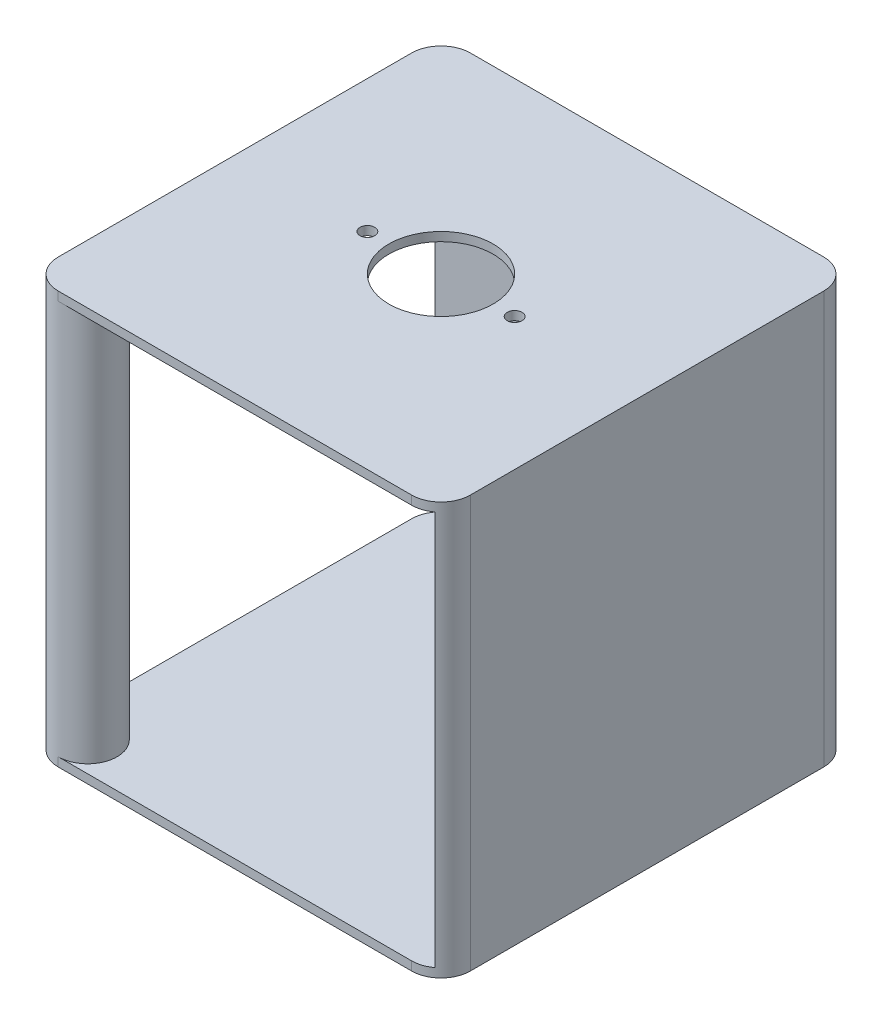
ISO-10303-21;
HEADER;
FILE_DESCRIPTION(('STEP AP214'),'2;1');
FILE_NAME('part.step','',(''),(''),'','','');
FILE_SCHEMA(('AUTOMOTIVE_DESIGN { 1 0 10303 214 1 1 1 1 }'));
ENDSEC;
DATA;
#1=APPLICATION_CONTEXT('core data for automotive mechanical design processes');
#2=APPLICATION_PROTOCOL_DEFINITION('international standard','automotive_design',2000,#1);
#3=PRODUCT_CONTEXT('',#1,'mechanical');
#4=PRODUCT('Part','Part','',(#3));
#5=PRODUCT_RELATED_PRODUCT_CATEGORY('part','',(#4));
#6=PRODUCT_DEFINITION_FORMATION('','',#4);
#7=PRODUCT_DEFINITION_CONTEXT('part definition',#1,'design');
#8=PRODUCT_DEFINITION('design','',#6,#7);
#9=PRODUCT_DEFINITION_SHAPE('','',#8);
#10=(LENGTH_UNIT() NAMED_UNIT(*) SI_UNIT(.MILLI.,.METRE.));
#11=(NAMED_UNIT(*) PLANE_ANGLE_UNIT() SI_UNIT($,.RADIAN.));
#12=(NAMED_UNIT(*) SI_UNIT($,.STERADIAN.) SOLID_ANGLE_UNIT());
#13=UNCERTAINTY_MEASURE_WITH_UNIT(LENGTH_MEASURE(1.E-05),#10,'distance_accuracy_value','');
#14=(GEOMETRIC_REPRESENTATION_CONTEXT(3) GLOBAL_UNCERTAINTY_ASSIGNED_CONTEXT((#13)) GLOBAL_UNIT_ASSIGNED_CONTEXT((#10,
#11,#12)) REPRESENTATION_CONTEXT('',''));
#15=CARTESIAN_POINT('',(0.,0.,0.));
#16=DIRECTION('',(0.,0.,1.));
#17=DIRECTION('',(1.,0.,0.));
#18=AXIS2_PLACEMENT_3D('',#15,#16,#17);
#19=CARTESIAN_POINT('',(38.1,1.905,38.1));
#20=DIRECTION('',(0.,-1.,0.));
#21=DIRECTION('',(0.,0.,-1.));
#22=AXIS2_PLACEMENT_3D('',#19,#20,#21);
#23=CYLINDRICAL_SURFACE('',#22,6.34999999999998);
#24=CARTESIAN_POINT('',(38.1,0.,38.1));
#25=DIRECTION('',(0.,-1.,0.));
#26=DIRECTION('',(0.,0.,-1.));
#27=AXIS2_PLACEMENT_3D('',#24,#25,#26);
#28=CIRCLE('',#27,6.34999999999998);
#29=CARTESIAN_POINT('',(41.91,0.,43.18));
#30=VERTEX_POINT('',#29);
#31=CARTESIAN_POINT('',(38.1,0.,44.45));
#32=VERTEX_POINT('',#31);
#33=EDGE_CURVE('E315',#30,#32,#28,.T.);
#34=ORIENTED_EDGE('',*,*,#33,.F.);
#35=DIRECTION('',(0.,-1.,0.));
#36=VECTOR('',#35,1.);
#37=CARTESIAN_POINT('',(41.91,1.905,43.18));
#38=LINE('',#37,#36);
#39=CARTESIAN_POINT('',(41.91,-85.0899999999999,43.18));
#40=VERTEX_POINT('',#39);
#41=EDGE_CURVE('E176',#40,#30,#38,.F.);
#42=ORIENTED_EDGE('',*,*,#41,.F.);
#43=CARTESIAN_POINT('',(38.1,-85.0899999999999,38.1));
#44=DIRECTION('',(0.,1.,0.));
#45=DIRECTION('',(0.,0.,1.));
#46=AXIS2_PLACEMENT_3D('',#43,#44,#45);
#47=CIRCLE('',#46,6.34999999999998);
#48=CARTESIAN_POINT('',(38.1,-85.0899999999999,44.45));
#49=VERTEX_POINT('',#48);
#50=EDGE_CURVE('E299',#49,#40,#47,.T.);
#51=ORIENTED_EDGE('',*,*,#50,.F.);
#52=DIRECTION('',(0.,-1.,0.));
#53=VECTOR('',#52,1.);
#54=CARTESIAN_POINT('',(38.1,1.905,44.45));
#55=LINE('',#54,#53);
#56=CARTESIAN_POINT('',(38.1,-86.995,44.45));
#57=VERTEX_POINT('',#56);
#58=EDGE_CURVE('E284',#49,#57,#55,.T.);
#59=ORIENTED_EDGE('',*,*,#58,.T.);
#60=CARTESIAN_POINT('',(38.1,-86.995,38.1));
#61=DIRECTION('',(0.,1.,0.));
#62=DIRECTION('',(0.,0.,1.));
#63=AXIS2_PLACEMENT_3D('',#60,#61,#62);
#64=CIRCLE('',#63,6.34999999999998);
#65=CARTESIAN_POINT('',(44.45,-86.995,38.1));
#66=VERTEX_POINT('',#65);
#67=EDGE_CURVE('E237',#57,#66,#64,.T.);
#68=ORIENTED_EDGE('',*,*,#67,.T.);
#69=DIRECTION('',(0.,-1.,0.));
#70=VECTOR('',#69,1.);
#71=CARTESIAN_POINT('',(44.45,1.905,38.1));
#72=LINE('',#71,#70);
#73=CARTESIAN_POINT('',(44.45,1.905,38.1));
#74=VERTEX_POINT('',#73);
#75=EDGE_CURVE('E282',#74,#66,#72,.T.);
#76=ORIENTED_EDGE('',*,*,#75,.F.);
#77=CARTESIAN_POINT('',(38.1,1.905,38.1));
#78=DIRECTION('',(0.,1.,0.));
#79=DIRECTION('',(0.,0.,1.));
#80=AXIS2_PLACEMENT_3D('',#77,#78,#79);
#81=CIRCLE('',#80,6.34999999999998);
#82=CARTESIAN_POINT('',(38.1,1.905,44.45));
#83=VERTEX_POINT('',#82);
#84=EDGE_CURVE('E264',#83,#74,#81,.T.);
#85=ORIENTED_EDGE('',*,*,#84,.F.);
#86=EDGE_CURVE('E285',#83,#32,#55,.T.);
#87=ORIENTED_EDGE('',*,*,#86,.T.);
#88=EDGE_LOOP('',(#34,#42,#51,#59,#68,#76,#85,#87));
#89=FACE_BOUND('',#88,.T.);
#90=ADVANCED_FACE('F45',(#89),#23,.T.);
#91=CARTESIAN_POINT('',(-44.45,1.905,38.1));
#92=DIRECTION('',(1.,0.,0.));
#93=DIRECTION('',(0.,0.,-1.));
#94=AXIS2_PLACEMENT_3D('',#91,#92,#93);
#95=PLANE('',#94);
#96=DIRECTION('',(0.,-1.,0.));
#97=VECTOR('',#96,1.);
#98=CARTESIAN_POINT('',(-44.45,1.905,38.1));
#99=LINE('',#98,#97);
#100=CARTESIAN_POINT('',(-44.45,-85.09,38.1));
#101=VERTEX_POINT('',#100);
#102=CARTESIAN_POINT('',(-44.45,-86.995,38.1));
#103=VERTEX_POINT('',#102);
#104=EDGE_CURVE('E169',#101,#103,#99,.T.);
#105=ORIENTED_EDGE('',*,*,#104,.F.);
#106=DIRECTION('',(0.,0.,1.));
#107=VECTOR('',#106,1.);
#108=CARTESIAN_POINT('',(-44.45,-85.09,-41.91));
#109=LINE('',#108,#107);
#110=CARTESIAN_POINT('',(-44.45,-85.09,-38.1));
#111=VERTEX_POINT('',#110);
#112=EDGE_CURVE('E180',#111,#101,#109,.T.);
#113=ORIENTED_EDGE('',*,*,#112,.F.);
#114=DIRECTION('',(0.,-1.,0.));
#115=VECTOR('',#114,1.);
#116=CARTESIAN_POINT('',(-44.45,1.905,-38.1));
#117=LINE('',#116,#115);
#118=CARTESIAN_POINT('',(-44.45,-86.995,-38.1));
#119=VERTEX_POINT('',#118);
#120=EDGE_CURVE('E200',#111,#119,#117,.T.);
#121=ORIENTED_EDGE('',*,*,#120,.T.);
#122=DIRECTION('',(0.,0.,1.));
#123=VECTOR('',#122,1.);
#124=CARTESIAN_POINT('',(-44.45,-86.995,38.1));
#125=LINE('',#124,#123);
#126=EDGE_CURVE('E193',#119,#103,#125,.T.);
#127=ORIENTED_EDGE('',*,*,#126,.T.);
#128=EDGE_LOOP('',(#105,#113,#121,#127));
#129=FACE_BOUND('',#128,.T.);
#130=ADVANCED_FACE('F191',(#129),#95,.F.);
#131=CARTESIAN_POINT('',(-38.1,1.905,44.45));
#132=DIRECTION('',(0.,0.,-1.));
#133=DIRECTION('',(-1.,0.,0.));
#134=AXIS2_PLACEMENT_3D('',#131,#132,#133);
#135=PLANE('',#134);
#136=ORIENTED_EDGE('',*,*,#58,.F.);
#137=DIRECTION('',(1.,0.,0.));
#138=VECTOR('',#137,1.);
#139=CARTESIAN_POINT('',(38.1,-85.09,44.45));
#140=LINE('',#139,#138);
#141=CARTESIAN_POINT('',(-38.1,-85.09,44.45));
#142=VERTEX_POINT('',#141);
#143=EDGE_CURVE('E304',#142,#49,#140,.T.);
#144=ORIENTED_EDGE('',*,*,#143,.F.);
#145=DIRECTION('',(0.,-1.,0.));
#146=VECTOR('',#145,1.);
#147=CARTESIAN_POINT('',(-38.1,1.905,44.45));
#148=LINE('',#147,#146);
#149=CARTESIAN_POINT('',(-38.1,-86.995,44.45));
#150=VERTEX_POINT('',#149);
#151=EDGE_CURVE('E171',#142,#150,#148,.T.);
#152=ORIENTED_EDGE('',*,*,#151,.T.);
#153=DIRECTION('',(1.,0.,0.));
#154=VECTOR('',#153,1.);
#155=CARTESIAN_POINT('',(-38.1,-86.995,44.45));
#156=LINE('',#155,#154);
#157=EDGE_CURVE('E233',#150,#57,#156,.T.);
#158=ORIENTED_EDGE('',*,*,#157,.T.);
#159=EDGE_LOOP('',(#136,#144,#152,#158));
#160=FACE_BOUND('',#159,.T.);
#161=ADVANCED_FACE('F303',(#160),#135,.F.);
#162=CARTESIAN_POINT('',(-38.1,1.905,-38.1));
#163=DIRECTION('',(0.,-1.,0.));
#164=DIRECTION('',(0.,0.,-1.));
#165=AXIS2_PLACEMENT_3D('',#162,#163,#164);
#166=CYLINDRICAL_SURFACE('',#165,6.34999999999999);
#167=ORIENTED_EDGE('',*,*,#120,.F.);
#168=CARTESIAN_POINT('',(-38.1,-85.09,-38.1));
#169=DIRECTION('',(0.,-1.,0.));
#170=DIRECTION('',(1.,0.,0.));
#171=AXIS2_PLACEMENT_3D('',#168,#169,#170);
#172=CIRCLE('',#171,6.34999999999999);
#173=CARTESIAN_POINT('',(-43.18,-85.09,-41.91));
#174=VERTEX_POINT('',#173);
#175=EDGE_CURVE('E183',#111,#174,#172,.T.);
#176=ORIENTED_EDGE('',*,*,#175,.T.);
#177=DIRECTION('',(0.,-1.,0.));
#178=VECTOR('',#177,1.);
#179=CARTESIAN_POINT('',(-43.18,1.905,-41.91));
#180=LINE('',#179,#178);
#181=CARTESIAN_POINT('',(-43.18,0.,-41.91));
#182=VERTEX_POINT('',#181);
#183=EDGE_CURVE('E319',#174,#182,#180,.F.);
#184=ORIENTED_EDGE('',*,*,#183,.T.);
#185=CARTESIAN_POINT('',(-38.1,0.,-38.1));
#186=DIRECTION('',(0.,1.,0.));
#187=DIRECTION('',(0.,0.,1.));
#188=AXIS2_PLACEMENT_3D('',#185,#186,#187);
#189=CIRCLE('',#188,6.34999999999999);
#190=CARTESIAN_POINT('',(-44.45,0.,-38.1));
#191=VERTEX_POINT('',#190);
#192=EDGE_CURVE('E333',#182,#191,#189,.T.);
#193=ORIENTED_EDGE('',*,*,#192,.T.);
#194=CARTESIAN_POINT('',(-44.45,1.905,-38.1));
#195=VERTEX_POINT('',#194);
#196=EDGE_CURVE('E54',#195,#191,#117,.T.);
#197=ORIENTED_EDGE('',*,*,#196,.F.);
#198=CARTESIAN_POINT('',(-38.1,1.905,-38.1));
#199=DIRECTION('',(0.,1.,0.));
#200=DIRECTION('',(0.,0.,1.));
#201=AXIS2_PLACEMENT_3D('',#198,#199,#200);
#202=CIRCLE('',#201,6.34999999999999);
#203=CARTESIAN_POINT('',(-38.1,1.905,-44.45));
#204=VERTEX_POINT('',#203);
#205=EDGE_CURVE('E252',#204,#195,#202,.T.);
#206=ORIENTED_EDGE('',*,*,#205,.F.);
#207=DIRECTION('',(0.,-1.,0.));
#208=VECTOR('',#207,1.);
#209=CARTESIAN_POINT('',(-38.1,1.905,-44.45));
#210=LINE('',#209,#208);
#211=CARTESIAN_POINT('',(-38.1,-86.995,-44.45));
#212=VERTEX_POINT('',#211);
#213=EDGE_CURVE('E222',#204,#212,#210,.T.);
#214=ORIENTED_EDGE('',*,*,#213,.T.);
#215=CARTESIAN_POINT('',(-38.1,-86.995,-38.1));
#216=DIRECTION('',(0.,1.,0.));
#217=DIRECTION('',(0.,0.,1.));
#218=AXIS2_PLACEMENT_3D('',#215,#216,#217);
#219=CIRCLE('',#218,6.34999999999999);
#220=EDGE_CURVE('E215',#212,#119,#219,.T.);
#221=ORIENTED_EDGE('',*,*,#220,.T.);
#222=EDGE_LOOP('',(#167,#176,#184,#193,#197,#206,#214,#221));
#223=FACE_BOUND('',#222,.T.);
#224=ADVANCED_FACE('F47',(#223),#166,.T.);
#225=ORIENTED_EDGE('',*,*,#196,.T.);
#226=DIRECTION('',(0.,0.,1.));
#227=VECTOR('',#226,1.);
#228=CARTESIAN_POINT('',(-44.45,0.,-41.91));
#229=LINE('',#228,#227);
#230=CARTESIAN_POINT('',(-44.45,0.,38.1));
#231=VERTEX_POINT('',#230);
#232=EDGE_CURVE('E188',#191,#231,#229,.T.);
#233=ORIENTED_EDGE('',*,*,#232,.T.);
#234=CARTESIAN_POINT('',(-44.45,1.905,38.1));
#235=VERTEX_POINT('',#234);
#236=EDGE_CURVE('E195',#235,#231,#99,.T.);
#237=ORIENTED_EDGE('',*,*,#236,.F.);
#238=DIRECTION('',(0.,0.,1.));
#239=VECTOR('',#238,1.);
#240=CARTESIAN_POINT('',(-44.45,1.905,38.1));
#241=LINE('',#240,#239);
#242=EDGE_CURVE('E255',#195,#235,#241,.T.);
#243=ORIENTED_EDGE('',*,*,#242,.F.);
#244=EDGE_LOOP('',(#225,#233,#237,#243));
#245=FACE_BOUND('',#244,.T.);
#246=ADVANCED_FACE('F371',(#245),#95,.F.);
#247=CARTESIAN_POINT('',(-38.1,1.905,38.1));
#248=DIRECTION('',(0.,-1.,0.));
#249=DIRECTION('',(0.,0.,-1.));
#250=AXIS2_PLACEMENT_3D('',#247,#248,#249);
#251=CYLINDRICAL_SURFACE('',#250,6.35);
#252=ORIENTED_EDGE('',*,*,#236,.T.);
#253=CARTESIAN_POINT('',(-38.1,0.,38.1));
#254=DIRECTION('',(0.,1.,0.));
#255=DIRECTION('',(0.,0.,1.));
#256=AXIS2_PLACEMENT_3D('',#253,#254,#255);
#257=CIRCLE('',#256,6.35);
#258=CARTESIAN_POINT('',(-38.1,0.,44.45));
#259=VERTEX_POINT('',#258);
#260=EDGE_CURVE('E11',#231,#259,#257,.F.);
#261=ORIENTED_EDGE('',*,*,#260,.T.);
#262=CARTESIAN_POINT('',(-38.1,1.905,44.45));
#263=VERTEX_POINT('',#262);
#264=EDGE_CURVE('E196',#263,#259,#148,.T.);
#265=ORIENTED_EDGE('',*,*,#264,.F.);
#266=CARTESIAN_POINT('',(-38.1,1.905,38.1));
#267=DIRECTION('',(0.,1.,0.));
#268=DIRECTION('',(0.,0.,1.));
#269=AXIS2_PLACEMENT_3D('',#266,#267,#268);
#270=CIRCLE('',#269,6.35);
#271=EDGE_CURVE('E258',#235,#263,#270,.T.);
#272=ORIENTED_EDGE('',*,*,#271,.F.);
#273=EDGE_LOOP('',(#252,#261,#265,#272));
#274=FACE_BOUND('',#273,.T.);
#275=ORIENTED_EDGE('',*,*,#151,.F.);
#276=CARTESIAN_POINT('',(-38.1,-85.09,38.1));
#277=DIRECTION('',(0.,1.,0.));
#278=DIRECTION('',(0.,0.,1.));
#279=AXIS2_PLACEMENT_3D('',#276,#277,#278);
#280=CIRCLE('',#279,6.35);
#281=EDGE_CURVE('E164',#142,#101,#280,.T.);
#282=ORIENTED_EDGE('',*,*,#281,.T.);
#283=ORIENTED_EDGE('',*,*,#104,.T.);
#284=CARTESIAN_POINT('',(-38.1,-86.995,38.1));
#285=DIRECTION('',(0.,1.,0.));
#286=DIRECTION('',(0.,0.,1.));
#287=AXIS2_PLACEMENT_3D('',#284,#285,#286);
#288=CIRCLE('',#287,6.35);
#289=EDGE_CURVE('E218',#103,#150,#288,.T.);
#290=ORIENTED_EDGE('',*,*,#289,.T.);
#291=EDGE_LOOP('',(#275,#282,#283,#290));
#292=FACE_BOUND('',#291,.T.);
#293=ADVANCED_FACE('F166',(#274,#292),#251,.T.);
#294=ORIENTED_EDGE('',*,*,#264,.T.);
#295=DIRECTION('',(-1.,0.,0.));
#296=VECTOR('',#295,1.);
#297=CARTESIAN_POINT('',(38.1,0.,44.45));
#298=LINE('',#297,#296);
#299=EDGE_CURVE('E307',#32,#259,#298,.T.);
#300=ORIENTED_EDGE('',*,*,#299,.F.);
#301=ORIENTED_EDGE('',*,*,#86,.F.);
#302=DIRECTION('',(1.,0.,0.));
#303=VECTOR('',#302,1.);
#304=CARTESIAN_POINT('',(-38.1,1.905,44.45));
#305=LINE('',#304,#303);
#306=EDGE_CURVE('E261',#263,#83,#305,.T.);
#307=ORIENTED_EDGE('',*,*,#306,.F.);
#308=EDGE_LOOP('',(#294,#300,#301,#307));
#309=FACE_BOUND('',#308,.T.);
#310=ADVANCED_FACE('F376',(#309),#135,.F.);
#311=CARTESIAN_POINT('',(44.45,1.905,-38.1));
#312=DIRECTION('',(-1.,0.,0.));
#313=DIRECTION('',(0.,0.,1.));
#314=AXIS2_PLACEMENT_3D('',#311,#312,#313);
#315=PLANE('',#314);
#316=ORIENTED_EDGE('',*,*,#75,.T.);
#317=DIRECTION('',(0.,0.,-1.));
#318=VECTOR('',#317,1.);
#319=CARTESIAN_POINT('',(44.45,-86.995,-38.1));
#320=LINE('',#319,#318);
#321=CARTESIAN_POINT('',(44.45,-86.995,-38.1));
#322=VERTEX_POINT('',#321);
#323=EDGE_CURVE('E241',#66,#322,#320,.T.);
#324=ORIENTED_EDGE('',*,*,#323,.T.);
#325=DIRECTION('',(0.,-1.,0.));
#326=VECTOR('',#325,1.);
#327=CARTESIAN_POINT('',(44.45,1.905,-38.1));
#328=LINE('',#327,#326);
#329=CARTESIAN_POINT('',(44.45,1.905,-38.1));
#330=VERTEX_POINT('',#329);
#331=EDGE_CURVE('E279',#330,#322,#328,.T.);
#332=ORIENTED_EDGE('',*,*,#331,.F.);
#333=DIRECTION('',(0.,0.,-1.));
#334=VECTOR('',#333,1.);
#335=CARTESIAN_POINT('',(44.45,1.905,-38.1));
#336=LINE('',#335,#334);
#337=EDGE_CURVE('E267',#74,#330,#336,.T.);
#338=ORIENTED_EDGE('',*,*,#337,.F.);
#339=EDGE_LOOP('',(#316,#324,#332,#338));
#340=FACE_BOUND('',#339,.T.);
#341=ADVANCED_FACE('F380',(#340),#315,.F.);
#342=CARTESIAN_POINT('',(38.1,1.905,-38.1));
#343=DIRECTION('',(0.,-1.,0.));
#344=DIRECTION('',(0.,0.,-1.));
#345=AXIS2_PLACEMENT_3D('',#342,#343,#344);
#346=CYLINDRICAL_SURFACE('',#345,6.34999999999999);
#347=ORIENTED_EDGE('',*,*,#331,.T.);
#348=CARTESIAN_POINT('',(38.1,-86.995,-38.1));
#349=DIRECTION('',(0.,1.,0.));
#350=DIRECTION('',(0.,0.,1.));
#351=AXIS2_PLACEMENT_3D('',#348,#349,#350);
#352=CIRCLE('',#351,6.34999999999999);
#353=CARTESIAN_POINT('',(38.1,-86.995,-44.45));
#354=VERTEX_POINT('',#353);
#355=EDGE_CURVE('E245',#322,#354,#352,.T.);
#356=ORIENTED_EDGE('',*,*,#355,.T.);
#357=DIRECTION('',(0.,-1.,0.));
#358=VECTOR('',#357,1.);
#359=CARTESIAN_POINT('',(38.1,1.905,-44.45));
#360=LINE('',#359,#358);
#361=CARTESIAN_POINT('',(38.1,1.905,-44.45));
#362=VERTEX_POINT('',#361);
#363=EDGE_CURVE('E276',#362,#354,#360,.T.);
#364=ORIENTED_EDGE('',*,*,#363,.F.);
#365=CARTESIAN_POINT('',(38.1,1.905,-38.1));
#366=DIRECTION('',(0.,1.,0.));
#367=DIRECTION('',(0.,0.,1.));
#368=AXIS2_PLACEMENT_3D('',#365,#366,#367);
#369=CIRCLE('',#368,6.34999999999999);
#370=EDGE_CURVE('E66',#330,#362,#369,.T.);
#371=ORIENTED_EDGE('',*,*,#370,.F.);
#372=EDGE_LOOP('',(#347,#356,#364,#371));
#373=FACE_BOUND('',#372,.T.);
#374=ADVANCED_FACE('F382',(#373),#346,.T.);
#375=CARTESIAN_POINT('',(-38.1,1.905,-44.45));
#376=DIRECTION('',(0.,0.,1.));
#377=DIRECTION('',(1.,0.,0.));
#378=AXIS2_PLACEMENT_3D('',#375,#376,#377);
#379=PLANE('',#378);
#380=ORIENTED_EDGE('',*,*,#363,.T.);
#381=DIRECTION('',(-1.,0.,0.));
#382=VECTOR('',#381,1.);
#383=CARTESIAN_POINT('',(-38.1,-86.995,-44.45));
#384=LINE('',#383,#382);
#385=EDGE_CURVE('E249',#354,#212,#384,.T.);
#386=ORIENTED_EDGE('',*,*,#385,.T.);
#387=ORIENTED_EDGE('',*,*,#213,.F.);
#388=DIRECTION('',(-1.,0.,0.));
#389=VECTOR('',#388,1.);
#390=CARTESIAN_POINT('',(-38.1,1.905,-44.45));
#391=LINE('',#390,#389);
#392=EDGE_CURVE('E61',#362,#204,#391,.T.);
#393=ORIENTED_EDGE('',*,*,#392,.F.);
#394=EDGE_LOOP('',(#380,#386,#387,#393));
#395=FACE_BOUND('',#394,.T.);
#396=ADVANCED_FACE('F384',(#395),#379,.F.);
#397=CARTESIAN_POINT('',(-38.1,1.905,-38.1));
#398=DIRECTION('',(0.,1.,0.));
#399=DIRECTION('',(0.,0.,1.));
#400=AXIS2_PLACEMENT_3D('',#397,#398,#399);
#401=PLANE('',#400);
#402=CARTESIAN_POINT('',(15.875,1.905,0.));
#403=DIRECTION('',(0.,1.,0.));
#404=DIRECTION('',(0.,0.,1.));
#405=AXIS2_PLACEMENT_3D('',#402,#403,#404);
#406=CIRCLE('',#405,1.5875);
#407=CARTESIAN_POINT('',(15.875,1.905,1.5875));
#408=VERTEX_POINT('',#407);
#409=EDGE_CURVE('E634',#408,#408,#406,.T.);
#410=ORIENTED_EDGE('',*,*,#409,.F.);
#411=EDGE_LOOP('',(#410));
#412=FACE_BOUND('',#411,.T.);
#413=CARTESIAN_POINT('',(-15.875,1.905,0.));
#414=DIRECTION('',(0.,1.,0.));
#415=DIRECTION('',(0.,0.,1.));
#416=AXIS2_PLACEMENT_3D('',#413,#414,#415);
#417=CIRCLE('',#416,1.5875);
#418=CARTESIAN_POINT('',(-15.875,1.905,1.5875));
#419=VERTEX_POINT('',#418);
#420=EDGE_CURVE('E633',#419,#419,#417,.T.);
#421=ORIENTED_EDGE('',*,*,#420,.F.);
#422=EDGE_LOOP('',(#421));
#423=FACE_BOUND('',#422,.T.);
#424=CARTESIAN_POINT('',(0.,1.905,0.));
#425=DIRECTION('',(0.,1.,0.));
#426=DIRECTION('',(0.,0.,1.));
#427=AXIS2_PLACEMENT_3D('',#424,#425,#426);
#428=CIRCLE('',#427,11.2395);
#429=CARTESIAN_POINT('',(0.,1.905,11.2395));
#430=VERTEX_POINT('',#429);
#431=EDGE_CURVE('E629',#430,#430,#428,.T.);
#432=ORIENTED_EDGE('',*,*,#431,.F.);
#433=EDGE_LOOP('',(#432));
#434=FACE_BOUND('',#433,.T.);
#435=ORIENTED_EDGE('',*,*,#205,.T.);
#436=ORIENTED_EDGE('',*,*,#242,.T.);
#437=ORIENTED_EDGE('',*,*,#271,.T.);
#438=ORIENTED_EDGE('',*,*,#306,.T.);
#439=ORIENTED_EDGE('',*,*,#84,.T.);
#440=ORIENTED_EDGE('',*,*,#337,.T.);
#441=ORIENTED_EDGE('',*,*,#370,.T.);
#442=ORIENTED_EDGE('',*,*,#392,.T.);
#443=EDGE_LOOP('',(#435,#436,#437,#438,#439,#440,#441,#442));
#444=FACE_BOUND('',#443,.T.);
#445=ADVANCED_FACE('F367',(#412,#423,#434,#444),#401,.T.);
#446=CARTESIAN_POINT('',(-38.1,-86.995,-38.1));
#447=DIRECTION('',(0.,1.,0.));
#448=DIRECTION('',(0.,0.,1.));
#449=AXIS2_PLACEMENT_3D('',#446,#447,#448);
#450=PLANE('',#449);
#451=ORIENTED_EDGE('',*,*,#220,.F.);
#452=ORIENTED_EDGE('',*,*,#385,.F.);
#453=ORIENTED_EDGE('',*,*,#355,.F.);
#454=ORIENTED_EDGE('',*,*,#323,.F.);
#455=ORIENTED_EDGE('',*,*,#67,.F.);
#456=ORIENTED_EDGE('',*,*,#157,.F.);
#457=ORIENTED_EDGE('',*,*,#289,.F.);
#458=ORIENTED_EDGE('',*,*,#126,.F.);
#459=EDGE_LOOP('',(#451,#452,#453,#454,#455,#456,#457,#458));
#460=FACE_BOUND('',#459,.T.);
#461=ADVANCED_FACE('F213',(#460),#450,.F.);
#462=CARTESIAN_POINT('',(-35.56,-85.09,-41.91));
#463=DIRECTION('',(0.,0.,-1.));
#464=DIRECTION('',(-1.,0.,0.));
#465=AXIS2_PLACEMENT_3D('',#462,#463,#464);
#466=PLANE('',#465);
#467=DIRECTION('',(-1.,0.,0.));
#468=VECTOR('',#467,1.);
#469=CARTESIAN_POINT('',(-35.56,0.,-41.91));
#470=LINE('',#469,#468);
#471=CARTESIAN_POINT('',(38.1,0.,-41.91));
#472=VERTEX_POINT('',#471);
#473=EDGE_CURVE('E345',#472,#182,#470,.T.);
#474=ORIENTED_EDGE('',*,*,#473,.T.);
#475=ORIENTED_EDGE('',*,*,#183,.F.);
#476=DIRECTION('',(-1.,0.,0.));
#477=VECTOR('',#476,1.);
#478=CARTESIAN_POINT('',(-35.56,-85.09,-41.91));
#479=LINE('',#478,#477);
#480=CARTESIAN_POINT('',(38.1,-85.09,-41.91));
#481=VERTEX_POINT('',#480);
#482=EDGE_CURVE('E227',#481,#174,#479,.T.);
#483=ORIENTED_EDGE('',*,*,#482,.F.);
#484=DIRECTION('',(0.,1.,0.));
#485=VECTOR('',#484,1.);
#486=CARTESIAN_POINT('',(38.1,0.,-41.91));
#487=LINE('',#486,#485);
#488=EDGE_CURVE('E306',#481,#472,#487,.T.);
#489=ORIENTED_EDGE('',*,*,#488,.T.);
#490=EDGE_LOOP('',(#474,#475,#483,#489));
#491=FACE_BOUND('',#490,.T.);
#492=ADVANCED_FACE('F361',(#491),#466,.F.);
#493=CARTESIAN_POINT('',(35.56,-85.09,-35.56));
#494=DIRECTION('',(0.,1.,0.));
#495=DIRECTION('',(0.,0.,1.));
#496=AXIS2_PLACEMENT_3D('',#493,#494,#495);
#497=CYLINDRICAL_SURFACE('',#496,6.34999999999999);
#498=CARTESIAN_POINT('',(35.56,0.,-35.56));
#499=DIRECTION('',(0.,1.,0.));
#500=DIRECTION('',(0.,0.,-1.));
#501=AXIS2_PLACEMENT_3D('',#498,#499,#500);
#502=CIRCLE('',#501,6.34999999999999);
#503=CARTESIAN_POINT('',(41.91,0.,-35.56));
#504=VERTEX_POINT('',#503);
#505=CARTESIAN_POINT('',(38.1,0.,-41.3798711325939));
#506=VERTEX_POINT('',#505);
#507=EDGE_CURVE('E354',#504,#506,#502,.T.);
#508=ORIENTED_EDGE('',*,*,#507,.T.);
#509=DIRECTION('',(0.,1.,0.));
#510=VECTOR('',#509,1.);
#511=CARTESIAN_POINT('',(38.1,-85.09,-41.3798711325939));
#512=LINE('',#511,#510);
#513=CARTESIAN_POINT('',(38.1,-85.09,-41.3798711325939));
#514=VERTEX_POINT('',#513);
#515=EDGE_CURVE('E329',#506,#514,#512,.F.);
#516=ORIENTED_EDGE('',*,*,#515,.T.);
#517=CARTESIAN_POINT('',(35.56,-85.09,-35.56));
#518=DIRECTION('',(0.,1.,0.));
#519=DIRECTION('',(0.,0.,-1.));
#520=AXIS2_PLACEMENT_3D('',#517,#518,#519);
#521=CIRCLE('',#520,6.34999999999999);
#522=CARTESIAN_POINT('',(41.91,-85.09,-35.56));
#523=VERTEX_POINT('',#522);
#524=EDGE_CURVE('E344',#523,#514,#521,.T.);
#525=ORIENTED_EDGE('',*,*,#524,.F.);
#526=DIRECTION('',(0.,1.,0.));
#527=VECTOR('',#526,1.);
#528=CARTESIAN_POINT('',(41.91,-85.09,-35.56));
#529=LINE('',#528,#527);
#530=EDGE_CURVE('E224',#523,#504,#529,.T.);
#531=ORIENTED_EDGE('',*,*,#530,.T.);
#532=EDGE_LOOP('',(#508,#516,#525,#531));
#533=FACE_BOUND('',#532,.T.);
#534=ADVANCED_FACE('F428',(#533),#497,.F.);
#535=CARTESIAN_POINT('',(41.91,-85.09,-35.56));
#536=DIRECTION('',(1.,0.,0.));
#537=DIRECTION('',(0.,0.,-1.));
#538=AXIS2_PLACEMENT_3D('',#535,#536,#537);
#539=PLANE('',#538);
#540=DIRECTION('',(0.,0.,-1.));
#541=VECTOR('',#540,1.);
#542=CARTESIAN_POINT('',(41.91,0.,-35.56));
#543=LINE('',#542,#541);
#544=EDGE_CURVE('E339',#30,#504,#543,.T.);
#545=ORIENTED_EDGE('',*,*,#544,.T.);
#546=ORIENTED_EDGE('',*,*,#530,.F.);
#547=DIRECTION('',(0.,0.,-1.));
#548=VECTOR('',#547,1.);
#549=CARTESIAN_POINT('',(41.91,-85.09,-35.56));
#550=LINE('',#549,#548);
#551=EDGE_CURVE('E340',#40,#523,#550,.T.);
#552=ORIENTED_EDGE('',*,*,#551,.F.);
#553=ORIENTED_EDGE('',*,*,#41,.T.);
#554=EDGE_LOOP('',(#545,#546,#552,#553));
#555=FACE_BOUND('',#554,.T.);
#556=ADVANCED_FACE('F425',(#555),#539,.F.);
#557=CARTESIAN_POINT('',(-35.56,-85.09,35.56));
#558=DIRECTION('',(0.,1.,0.));
#559=DIRECTION('',(0.,0.,1.));
#560=AXIS2_PLACEMENT_3D('',#557,#558,#559);
#561=PLANE('',#560);
#562=ORIENTED_EDGE('',*,*,#112,.T.);
#563=ORIENTED_EDGE('',*,*,#281,.F.);
#564=ORIENTED_EDGE('',*,*,#143,.T.);
#565=ORIENTED_EDGE('',*,*,#50,.T.);
#566=ORIENTED_EDGE('',*,*,#551,.T.);
#567=ORIENTED_EDGE('',*,*,#524,.T.);
#568=DIRECTION('',(0.,0.,1.));
#569=VECTOR('',#568,1.);
#570=CARTESIAN_POINT('',(38.1,-85.09,-41.91));
#571=LINE('',#570,#569);
#572=EDGE_CURVE('E187',#481,#514,#571,.T.);
#573=ORIENTED_EDGE('',*,*,#572,.F.);
#574=ORIENTED_EDGE('',*,*,#482,.T.);
#575=ORIENTED_EDGE('',*,*,#175,.F.);
#576=EDGE_LOOP('',(#562,#563,#564,#565,#566,#567,#573,#574,#575));
#577=FACE_BOUND('',#576,.T.);
#578=ADVANCED_FACE('F181',(#577),#561,.T.);
#579=CARTESIAN_POINT('',(-35.56,0.,35.56));
#580=DIRECTION('',(0.,1.,0.));
#581=DIRECTION('',(0.,0.,1.));
#582=AXIS2_PLACEMENT_3D('',#579,#580,#581);
#583=PLANE('',#582);
#584=CARTESIAN_POINT('',(15.875,0.,0.));
#585=DIRECTION('',(0.,1.,0.));
#586=DIRECTION('',(0.,0.,1.));
#587=AXIS2_PLACEMENT_3D('',#584,#585,#586);
#588=CIRCLE('',#587,1.5875);
#589=CARTESIAN_POINT('',(15.875,0.,1.5875));
#590=VERTEX_POINT('',#589);
#591=EDGE_CURVE('E638',#590,#590,#588,.F.);
#592=ORIENTED_EDGE('',*,*,#591,.F.);
#593=EDGE_LOOP('',(#592));
#594=FACE_BOUND('',#593,.T.);
#595=CARTESIAN_POINT('',(-15.875,0.,0.));
#596=DIRECTION('',(0.,1.,0.));
#597=DIRECTION('',(0.,0.,1.));
#598=AXIS2_PLACEMENT_3D('',#595,#596,#597);
#599=CIRCLE('',#598,1.5875);
#600=CARTESIAN_POINT('',(-15.875,0.,1.5875));
#601=VERTEX_POINT('',#600);
#602=EDGE_CURVE('E637',#601,#601,#599,.F.);
#603=ORIENTED_EDGE('',*,*,#602,.F.);
#604=EDGE_LOOP('',(#603));
#605=FACE_BOUND('',#604,.T.);
#606=CARTESIAN_POINT('',(0.,0.,0.));
#607=DIRECTION('',(0.,1.,0.));
#608=DIRECTION('',(0.,0.,1.));
#609=AXIS2_PLACEMENT_3D('',#606,#607,#608);
#610=CIRCLE('',#609,11.2395);
#611=CARTESIAN_POINT('',(0.,0.,11.2395));
#612=VERTEX_POINT('',#611);
#613=EDGE_CURVE('E177',#612,#612,#610,.F.);
#614=ORIENTED_EDGE('',*,*,#613,.F.);
#615=EDGE_LOOP('',(#614));
#616=FACE_BOUND('',#615,.T.);
#617=ORIENTED_EDGE('',*,*,#260,.F.);
#618=ORIENTED_EDGE('',*,*,#232,.F.);
#619=ORIENTED_EDGE('',*,*,#192,.F.);
#620=ORIENTED_EDGE('',*,*,#473,.F.);
#621=DIRECTION('',(0.,0.,1.));
#622=VECTOR('',#621,1.);
#623=CARTESIAN_POINT('',(38.1,0.,-41.91));
#624=LINE('',#623,#622);
#625=EDGE_CURVE('E312',#472,#506,#624,.T.);
#626=ORIENTED_EDGE('',*,*,#625,.T.);
#627=ORIENTED_EDGE('',*,*,#507,.F.);
#628=ORIENTED_EDGE('',*,*,#544,.F.);
#629=ORIENTED_EDGE('',*,*,#33,.T.);
#630=ORIENTED_EDGE('',*,*,#299,.T.);
#631=EDGE_LOOP('',(#617,#618,#619,#620,#626,#627,#628,#629,#630));
#632=FACE_BOUND('',#631,.T.);
#633=ADVANCED_FACE('F366',(#594,#605,#616,#632),#583,.F.);
#634=CARTESIAN_POINT('',(38.1,0.,-41.91));
#635=DIRECTION('',(1.,0.,0.));
#636=DIRECTION('',(0.,1.,0.));
#637=AXIS2_PLACEMENT_3D('',#634,#635,#636);
#638=PLANE('',#637);
#639=ORIENTED_EDGE('',*,*,#625,.F.);
#640=ORIENTED_EDGE('',*,*,#488,.F.);
#641=ORIENTED_EDGE('',*,*,#572,.T.);
#642=ORIENTED_EDGE('',*,*,#515,.F.);
#643=EDGE_LOOP('',(#639,#640,#641,#642));
#644=FACE_BOUND('',#643,.T.);
#645=ADVANCED_FACE('F459',(#644),#638,.F.);
#646=CARTESIAN_POINT('',(0.,-86.996,0.));
#647=DIRECTION('',(0.,1.,0.));
#648=DIRECTION('',(0.,0.,1.));
#649=AXIS2_PLACEMENT_3D('',#646,#647,#648);
#650=CYLINDRICAL_SURFACE('',#649,11.2395);
#651=ORIENTED_EDGE('',*,*,#431,.T.);
#652=EDGE_LOOP('',(#651));
#653=FACE_BOUND('',#652,.T.);
#654=ORIENTED_EDGE('',*,*,#613,.T.);
#655=EDGE_LOOP('',(#654));
#656=FACE_BOUND('',#655,.T.);
#657=ADVANCED_FACE('F477',(#653,#656),#650,.F.);
#658=CARTESIAN_POINT('',(-15.875,-86.996,0.));
#659=DIRECTION('',(0.,1.,0.));
#660=DIRECTION('',(0.,0.,1.));
#661=AXIS2_PLACEMENT_3D('',#658,#659,#660);
#662=CYLINDRICAL_SURFACE('',#661,1.5875);
#663=ORIENTED_EDGE('',*,*,#420,.T.);
#664=EDGE_LOOP('',(#663));
#665=FACE_BOUND('',#664,.T.);
#666=ORIENTED_EDGE('',*,*,#602,.T.);
#667=EDGE_LOOP('',(#666));
#668=FACE_BOUND('',#667,.T.);
#669=ADVANCED_FACE('F482',(#665,#668),#662,.F.);
#670=CARTESIAN_POINT('',(15.875,-86.996,0.));
#671=DIRECTION('',(0.,1.,0.));
#672=DIRECTION('',(0.,0.,1.));
#673=AXIS2_PLACEMENT_3D('',#670,#671,#672);
#674=CYLINDRICAL_SURFACE('',#673,1.5875);
#675=ORIENTED_EDGE('',*,*,#409,.T.);
#676=EDGE_LOOP('',(#675));
#677=FACE_BOUND('',#676,.T.);
#678=ORIENTED_EDGE('',*,*,#591,.T.);
#679=EDGE_LOOP('',(#678));
#680=FACE_BOUND('',#679,.T.);
#681=ADVANCED_FACE('F492',(#677,#680),#674,.F.);
#682=CLOSED_SHELL('',(#90,#130,#161,#224,#246,#293,#310,#341,#374,#396,#445,#461,#492,#534,#556,
#578,#633,#645,#657,#669,#681));
#683=MANIFOLD_SOLID_BREP('B2',#682);
#684=ADVANCED_BREP_SHAPE_REPRESENTATION('',(#18,#683),#14);
#685=SHAPE_DEFINITION_REPRESENTATION(#9,#684);
ENDSEC;
END-ISO-10303-21;
